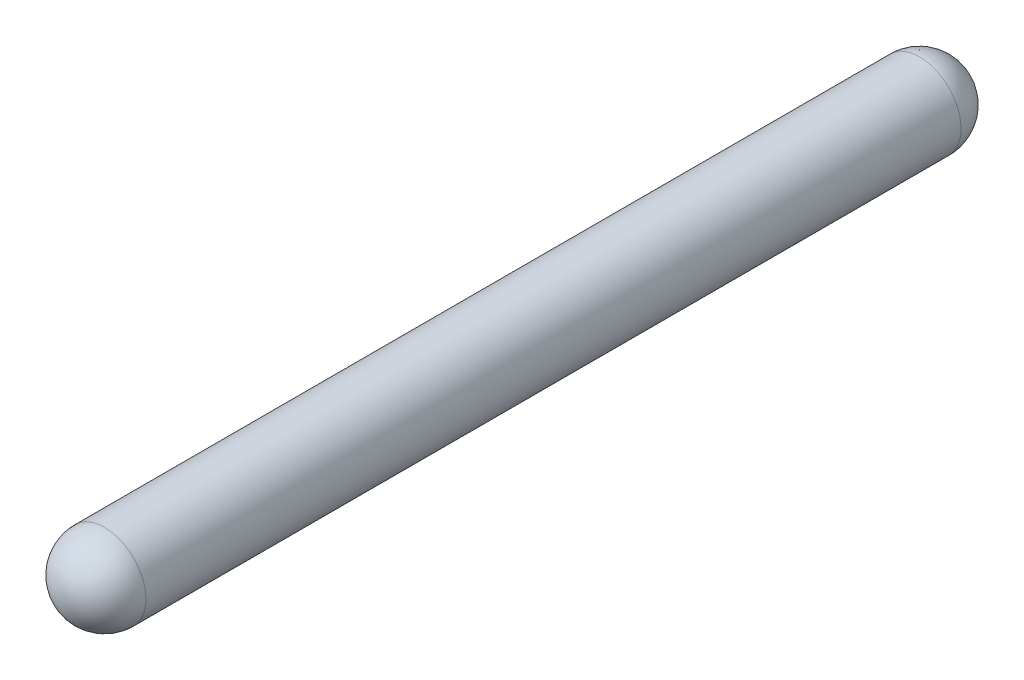
ISO-10303-21;
HEADER;
FILE_DESCRIPTION(('STEP AP214'),'2;1');
FILE_NAME('part.step','',(''),(''),'','','');
FILE_SCHEMA(('AUTOMOTIVE_DESIGN { 1 0 10303 214 1 1 1 1 }'));
ENDSEC;
DATA;
#1=APPLICATION_CONTEXT('core data for automotive mechanical design processes');
#2=APPLICATION_PROTOCOL_DEFINITION('international standard','automotive_design',2000,#1);
#3=PRODUCT_CONTEXT('',#1,'mechanical');
#4=PRODUCT('Part','Part','',(#3));
#5=PRODUCT_RELATED_PRODUCT_CATEGORY('part','',(#4));
#6=PRODUCT_DEFINITION_FORMATION('','',#4);
#7=PRODUCT_DEFINITION_CONTEXT('part definition',#1,'design');
#8=PRODUCT_DEFINITION('design','',#6,#7);
#9=PRODUCT_DEFINITION_SHAPE('','',#8);
#10=(LENGTH_UNIT() NAMED_UNIT(*) SI_UNIT(.MILLI.,.METRE.));
#11=(NAMED_UNIT(*) PLANE_ANGLE_UNIT() SI_UNIT($,.RADIAN.));
#12=(NAMED_UNIT(*) SI_UNIT($,.STERADIAN.) SOLID_ANGLE_UNIT());
#13=UNCERTAINTY_MEASURE_WITH_UNIT(LENGTH_MEASURE(1.E-05),#10,'distance_accuracy_value','');
#14=(GEOMETRIC_REPRESENTATION_CONTEXT(3) GLOBAL_UNCERTAINTY_ASSIGNED_CONTEXT((#13)) GLOBAL_UNIT_ASSIGNED_CONTEXT((#10,
#11,#12)) REPRESENTATION_CONTEXT('',''));
#15=CARTESIAN_POINT('',(0.,0.,0.));
#16=DIRECTION('',(0.,0.,1.));
#17=DIRECTION('',(1.,0.,0.));
#18=AXIS2_PLACEMENT_3D('',#15,#16,#17);
#19=CARTESIAN_POINT('',(0.,-10.16,-3.));
#20=DIRECTION('',(1.,0.,0.));
#21=DIRECTION('',(0.,-1.,0.));
#22=AXIS2_PLACEMENT_3D('',#19,#20,#21);
#23=SPHERICAL_SURFACE('',#22,0.331);
#24=CARTESIAN_POINT('',(0.,-10.16,-3.));
#25=DIRECTION('',(0.,0.,1.));
#26=DIRECTION('',(1.,0.,0.));
#27=AXIS2_PLACEMENT_3D('',#24,#25,#26);
#28=CIRCLE('',#27,0.331);
#29=CARTESIAN_POINT('',(0.331,-10.16,-3.));
#30=VERTEX_POINT('',#29);
#31=CARTESIAN_POINT('',(-0.331,-10.16,-3.));
#32=VERTEX_POINT('',#31);
#33=EDGE_CURVE('E42',#30,#32,#28,.T.);
#34=ORIENTED_EDGE('',*,*,#33,.F.);
#35=CARTESIAN_POINT('',(0.,-10.16,-3.));
#36=DIRECTION('',(0.,0.,1.));
#37=DIRECTION('',(1.,0.,0.));
#38=AXIS2_PLACEMENT_3D('',#35,#36,#37);
#39=CIRCLE('',#38,0.331);
#40=EDGE_CURVE('E26',#32,#30,#39,.T.);
#41=ORIENTED_EDGE('',*,*,#40,.F.);
#42=EDGE_LOOP('',(#34,#41));
#43=FACE_BOUND('',#42,.T.);
#44=ADVANCED_FACE('F17',(#43),#23,.T.);
#45=CARTESIAN_POINT('',(0.,-10.16,3.5));
#46=DIRECTION('',(1.,0.,0.));
#47=DIRECTION('',(0.,1.,0.));
#48=AXIS2_PLACEMENT_3D('',#45,#46,#47);
#49=SPHERICAL_SURFACE('',#48,0.331);
#50=CARTESIAN_POINT('',(0.,-10.16,3.5));
#51=DIRECTION('',(0.,0.,1.));
#52=DIRECTION('',(1.,0.,0.));
#53=AXIS2_PLACEMENT_3D('',#50,#51,#52);
#54=CIRCLE('',#53,0.331);
#55=CARTESIAN_POINT('',(0.331,-10.16,3.5));
#56=VERTEX_POINT('',#55);
#57=CARTESIAN_POINT('',(-0.331,-10.16,3.5));
#58=VERTEX_POINT('',#57);
#59=EDGE_CURVE('E11',#56,#58,#54,.F.);
#60=ORIENTED_EDGE('',*,*,#59,.F.);
#61=CARTESIAN_POINT('',(0.,-10.16,3.5));
#62=DIRECTION('',(0.,0.,1.));
#63=DIRECTION('',(1.,0.,0.));
#64=AXIS2_PLACEMENT_3D('',#61,#62,#63);
#65=CIRCLE('',#64,0.331);
#66=EDGE_CURVE('E34',#58,#56,#65,.F.);
#67=ORIENTED_EDGE('',*,*,#66,.F.);
#68=EDGE_LOOP('',(#60,#67));
#69=FACE_BOUND('',#68,.T.);
#70=ADVANCED_FACE('F49',(#69),#49,.T.);
#71=CARTESIAN_POINT('',(0.,-10.16,-3.));
#72=DIRECTION('',(0.,0.,1.));
#73=DIRECTION('',(1.,0.,0.));
#74=AXIS2_PLACEMENT_3D('',#71,#72,#73);
#75=CYLINDRICAL_SURFACE('',#74,0.331);
#76=ORIENTED_EDGE('',*,*,#66,.T.);
#77=ORIENTED_EDGE('',*,*,#59,.T.);
#78=EDGE_LOOP('',(#76,#77));
#79=FACE_BOUND('',#78,.T.);
#80=ORIENTED_EDGE('',*,*,#40,.T.);
#81=ORIENTED_EDGE('',*,*,#33,.T.);
#82=EDGE_LOOP('',(#80,#81));
#83=FACE_BOUND('',#82,.T.);
#84=ADVANCED_FACE('F45',(#79,#83),#75,.T.);
#85=CLOSED_SHELL('',(#44,#70,#84));
#86=MANIFOLD_SOLID_BREP('B1',#85);
#87=ADVANCED_BREP_SHAPE_REPRESENTATION('',(#18,#86),#14);
#88=SHAPE_DEFINITION_REPRESENTATION(#9,#87);
ENDSEC;
END-ISO-10303-21;
